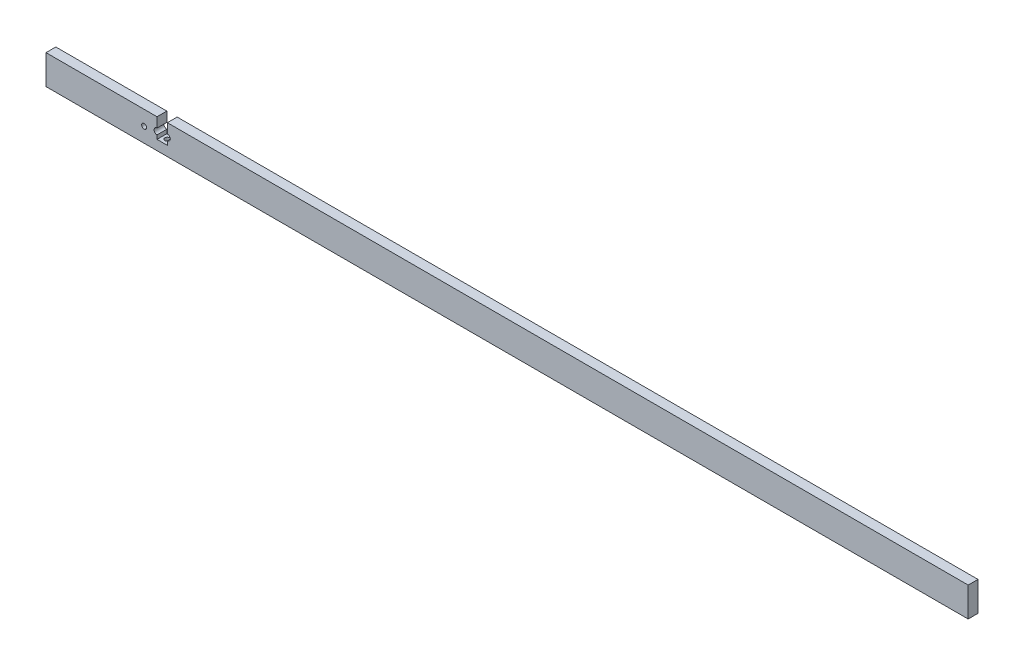
ISO-10303-21;
HEADER;
FILE_DESCRIPTION(('STEP AP214'),'2;1');
FILE_NAME('part.step','',(''),(''),'','','');
FILE_SCHEMA(('AUTOMOTIVE_DESIGN { 1 0 10303 214 1 1 1 1 }'));
ENDSEC;
DATA;
#1=APPLICATION_CONTEXT('core data for automotive mechanical design processes');
#2=APPLICATION_PROTOCOL_DEFINITION('international standard','automotive_design',2000,#1);
#3=PRODUCT_CONTEXT('',#1,'mechanical');
#4=PRODUCT('Part','Part','',(#3));
#5=PRODUCT_RELATED_PRODUCT_CATEGORY('part','',(#4));
#6=PRODUCT_DEFINITION_FORMATION('','',#4);
#7=PRODUCT_DEFINITION_CONTEXT('part definition',#1,'design');
#8=PRODUCT_DEFINITION('design','',#6,#7);
#9=PRODUCT_DEFINITION_SHAPE('','',#8);
#10=(LENGTH_UNIT() NAMED_UNIT(*) SI_UNIT(.MILLI.,.METRE.));
#11=(NAMED_UNIT(*) PLANE_ANGLE_UNIT() SI_UNIT($,.RADIAN.));
#12=(NAMED_UNIT(*) SI_UNIT($,.STERADIAN.) SOLID_ANGLE_UNIT());
#13=UNCERTAINTY_MEASURE_WITH_UNIT(LENGTH_MEASURE(1.E-05),#10,'distance_accuracy_value','');
#14=(GEOMETRIC_REPRESENTATION_CONTEXT(3) GLOBAL_UNCERTAINTY_ASSIGNED_CONTEXT((#13)) GLOBAL_UNIT_ASSIGNED_CONTEXT((#10,
#11,#12)) REPRESENTATION_CONTEXT('',''));
#15=CARTESIAN_POINT('',(0.,0.,0.));
#16=DIRECTION('',(0.,0.,1.));
#17=DIRECTION('',(1.,0.,0.));
#18=AXIS2_PLACEMENT_3D('',#15,#16,#17);
#19=CARTESIAN_POINT('',(-178.410038425183,7.50000000000003,0.));
#20=DIRECTION('',(-1.,0.,0.));
#21=DIRECTION('',(0.,-1.,0.));
#22=AXIS2_PLACEMENT_3D('',#19,#20,#21);
#23=PLANE('',#22);
#24=DIRECTION('',(0.,-1.,0.));
#25=VECTOR('',#24,1.);
#26=CARTESIAN_POINT('',(-178.410038425183,7.50000000000003,0.));
#27=LINE('',#26,#25);
#28=CARTESIAN_POINT('',(-178.410038425183,-0.499999999999966,0.));
#29=VERTEX_POINT('',#28);
#30=CARTESIAN_POINT('',(-178.410038425183,-2.49999999999997,0.));
#31=VERTEX_POINT('',#30);
#32=EDGE_CURVE('E145',#29,#31,#27,.T.);
#33=ORIENTED_EDGE('',*,*,#32,.F.);
#34=DIRECTION('',(0.,0.,1.));
#35=VECTOR('',#34,1.);
#36=CARTESIAN_POINT('',(-178.410038425183,-0.499999999999966,-5.));
#37=LINE('',#36,#35);
#38=CARTESIAN_POINT('',(-178.410038425183,-0.499999999999966,5.));
#39=VERTEX_POINT('',#38);
#40=EDGE_CURVE('E13',#29,#39,#37,.T.);
#41=ORIENTED_EDGE('',*,*,#40,.T.);
#42=DIRECTION('',(0.,-1.,0.));
#43=VECTOR('',#42,1.);
#44=CARTESIAN_POINT('',(-178.410038425183,7.50000000000003,5.));
#45=LINE('',#44,#43);
#46=CARTESIAN_POINT('',(-178.410038425183,-2.49999999999997,5.));
#47=VERTEX_POINT('',#46);
#48=EDGE_CURVE('E143',#39,#47,#45,.T.);
#49=ORIENTED_EDGE('',*,*,#48,.T.);
#50=DIRECTION('',(0.,0.,1.));
#51=VECTOR('',#50,1.);
#52=CARTESIAN_POINT('',(-178.410038425183,-2.49999999999997,0.));
#53=LINE('',#52,#51);
#54=EDGE_CURVE('E173',#31,#47,#53,.T.);
#55=ORIENTED_EDGE('',*,*,#54,.F.);
#56=EDGE_LOOP('',(#33,#41,#49,#55));
#57=FACE_BOUND('',#56,.T.);
#58=ADVANCED_FACE('F46',(#57),#23,.F.);
#59=CARTESIAN_POINT('',(-173.160038425183,-2.49999999999997,0.));
#60=DIRECTION('',(1.,0.,0.));
#61=DIRECTION('',(0.,0.,-1.));
#62=AXIS2_PLACEMENT_3D('',#59,#60,#61);
#63=PLANE('',#62);
#64=DIRECTION('',(0.,1.,0.));
#65=VECTOR('',#64,1.);
#66=CARTESIAN_POINT('',(-173.160038425183,-2.49999999999997,0.));
#67=LINE('',#66,#65);
#68=CARTESIAN_POINT('',(-173.160038425183,2.50000000000003,0.));
#69=VERTEX_POINT('',#68);
#70=CARTESIAN_POINT('',(-173.160038425183,7.50000000000003,0.));
#71=VERTEX_POINT('',#70);
#72=EDGE_CURVE('E232',#69,#71,#67,.T.);
#73=ORIENTED_EDGE('',*,*,#72,.F.);
#74=DIRECTION('',(0.,0.,1.));
#75=VECTOR('',#74,1.);
#76=CARTESIAN_POINT('',(-173.160038425183,2.50000000000003,-5.));
#77=LINE('',#76,#75);
#78=CARTESIAN_POINT('',(-173.160038425183,2.50000000000003,5.));
#79=VERTEX_POINT('',#78);
#80=EDGE_CURVE('E218',#69,#79,#77,.T.);
#81=ORIENTED_EDGE('',*,*,#80,.T.);
#82=DIRECTION('',(0.,1.,0.));
#83=VECTOR('',#82,1.);
#84=CARTESIAN_POINT('',(-173.160038425183,-2.49999999999997,5.));
#85=LINE('',#84,#83);
#86=CARTESIAN_POINT('',(-173.160038425183,7.50000000000003,5.));
#87=VERTEX_POINT('',#86);
#88=EDGE_CURVE('E163',#79,#87,#85,.T.);
#89=ORIENTED_EDGE('',*,*,#88,.T.);
#90=DIRECTION('',(0.,0.,1.));
#91=VECTOR('',#90,1.);
#92=CARTESIAN_POINT('',(-173.160038425183,7.50000000000003,0.));
#93=LINE('',#92,#91);
#94=EDGE_CURVE('E167',#71,#87,#93,.T.);
#95=ORIENTED_EDGE('',*,*,#94,.F.);
#96=EDGE_LOOP('',(#73,#81,#89,#95));
#97=FACE_BOUND('',#96,.T.);
#98=ADVANCED_FACE('F244',(#97),#63,.F.);
#99=CARTESIAN_POINT('',(235.,7.50000000000003,5.));
#100=DIRECTION('',(0.,-1.,0.));
#101=DIRECTION('',(1.,0.,0.));
#102=AXIS2_PLACEMENT_3D('',#99,#100,#101);
#103=PLANE('',#102);
#104=DIRECTION('',(-1.,0.,0.));
#105=VECTOR('',#104,1.);
#106=CARTESIAN_POINT('',(235.,7.50000000000003,0.));
#107=LINE('',#106,#105);
#108=CARTESIAN_POINT('',(235.,7.50000000000003,0.));
#109=VERTEX_POINT('',#108);
#110=EDGE_CURVE('E187',#109,#71,#107,.T.);
#111=ORIENTED_EDGE('',*,*,#110,.T.);
#112=ORIENTED_EDGE('',*,*,#94,.T.);
#113=DIRECTION('',(-1.,0.,0.));
#114=VECTOR('',#113,1.);
#115=CARTESIAN_POINT('',(235.,7.50000000000003,5.));
#116=LINE('',#115,#114);
#117=CARTESIAN_POINT('',(235.,7.50000000000003,5.));
#118=VERTEX_POINT('',#117);
#119=EDGE_CURVE('E192',#118,#87,#116,.T.);
#120=ORIENTED_EDGE('',*,*,#119,.F.);
#121=DIRECTION('',(0.,0.,-1.));
#122=VECTOR('',#121,1.);
#123=CARTESIAN_POINT('',(235.,7.50000000000003,5.));
#124=LINE('',#123,#122);
#125=EDGE_CURVE('E207',#118,#109,#124,.T.);
#126=ORIENTED_EDGE('',*,*,#125,.T.);
#127=EDGE_LOOP('',(#111,#112,#120,#126));
#128=FACE_BOUND('',#127,.T.);
#129=ADVANCED_FACE('F250',(#128),#103,.F.);
#130=CARTESIAN_POINT('',(-235.,-7.50000000000003,5.));
#131=DIRECTION('',(1.,0.,0.));
#132=DIRECTION('',(0.,0.,-1.));
#133=AXIS2_PLACEMENT_3D('',#130,#131,#132);
#134=PLANE('',#133);
#135=DIRECTION('',(0.,-1.,0.));
#136=VECTOR('',#135,1.);
#137=CARTESIAN_POINT('',(-235.,-7.50000000000003,0.));
#138=LINE('',#137,#136);
#139=CARTESIAN_POINT('',(-235.,7.49999999999998,0.));
#140=VERTEX_POINT('',#139);
#141=CARTESIAN_POINT('',(-235.,-7.50000000000003,0.));
#142=VERTEX_POINT('',#141);
#143=EDGE_CURVE('E180',#140,#142,#138,.T.);
#144=ORIENTED_EDGE('',*,*,#143,.T.);
#145=DIRECTION('',(0.,0.,-1.));
#146=VECTOR('',#145,1.);
#147=CARTESIAN_POINT('',(-235.,-7.50000000000003,5.));
#148=LINE('',#147,#146);
#149=CARTESIAN_POINT('',(-235.,-7.50000000000003,5.));
#150=VERTEX_POINT('',#149);
#151=EDGE_CURVE('E213',#150,#142,#148,.T.);
#152=ORIENTED_EDGE('',*,*,#151,.F.);
#153=DIRECTION('',(0.,-1.,0.));
#154=VECTOR('',#153,1.);
#155=CARTESIAN_POINT('',(-235.,-7.50000000000003,5.));
#156=LINE('',#155,#154);
#157=CARTESIAN_POINT('',(-235.,7.49999999999998,5.));
#158=VERTEX_POINT('',#157);
#159=EDGE_CURVE('E183',#158,#150,#156,.T.);
#160=ORIENTED_EDGE('',*,*,#159,.F.);
#161=DIRECTION('',(0.,0.,-1.));
#162=VECTOR('',#161,1.);
#163=CARTESIAN_POINT('',(-235.,7.49999999999998,5.));
#164=LINE('',#163,#162);
#165=EDGE_CURVE('E195',#158,#140,#164,.T.);
#166=ORIENTED_EDGE('',*,*,#165,.T.);
#167=EDGE_LOOP('',(#144,#152,#160,#166));
#168=FACE_BOUND('',#167,.T.);
#169=ADVANCED_FACE('F48',(#168),#134,.F.);
#170=CARTESIAN_POINT('',(235.,-7.49999999999998,5.));
#171=DIRECTION('',(0.,1.,0.));
#172=DIRECTION('',(-1.,0.,0.));
#173=AXIS2_PLACEMENT_3D('',#170,#171,#172);
#174=PLANE('',#173);
#175=CARTESIAN_POINT('',(-175.910038425183,-7.50000000000003,2.31270088468705));
#176=DIRECTION('',(0.,-1.,0.));
#177=DIRECTION('',(1.,0.,0.));
#178=AXIS2_PLACEMENT_3D('',#175,#176,#177);
#179=CIRCLE('',#178,1.25000000000001);
#180=CARTESIAN_POINT('',(-174.660038425183,-7.50000000000003,2.31270088468705));
#181=VERTEX_POINT('',#180);
#182=EDGE_CURVE('E156',#181,#181,#179,.T.);
#183=ORIENTED_EDGE('',*,*,#182,.F.);
#184=EDGE_LOOP('',(#183));
#185=FACE_BOUND('',#184,.T.);
#186=DIRECTION('',(1.,0.,0.));
#187=VECTOR('',#186,1.);
#188=CARTESIAN_POINT('',(235.,-7.49999999999998,0.));
#189=LINE('',#188,#187);
#190=CARTESIAN_POINT('',(235.,-7.49999999999998,0.));
#191=VERTEX_POINT('',#190);
#192=EDGE_CURVE('E198',#142,#191,#189,.T.);
#193=ORIENTED_EDGE('',*,*,#192,.T.);
#194=DIRECTION('',(0.,0.,-1.));
#195=VECTOR('',#194,1.);
#196=CARTESIAN_POINT('',(235.,-7.49999999999998,5.));
#197=LINE('',#196,#195);
#198=CARTESIAN_POINT('',(235.,-7.49999999999998,5.));
#199=VERTEX_POINT('',#198);
#200=EDGE_CURVE('E210',#199,#191,#197,.T.);
#201=ORIENTED_EDGE('',*,*,#200,.F.);
#202=DIRECTION('',(1.,0.,0.));
#203=VECTOR('',#202,1.);
#204=CARTESIAN_POINT('',(235.,-7.49999999999998,5.));
#205=LINE('',#204,#203);
#206=EDGE_CURVE('E186',#150,#199,#205,.T.);
#207=ORIENTED_EDGE('',*,*,#206,.F.);
#208=ORIENTED_EDGE('',*,*,#151,.T.);
#209=EDGE_LOOP('',(#193,#201,#207,#208));
#210=FACE_BOUND('',#209,.T.);
#211=ADVANCED_FACE('F290',(#185,#210),#174,.F.);
#212=CARTESIAN_POINT('',(235.,-7.49999999999998,5.));
#213=DIRECTION('',(-1.,0.,0.));
#214=DIRECTION('',(0.,0.,1.));
#215=AXIS2_PLACEMENT_3D('',#212,#213,#214);
#216=PLANE('',#215);
#217=DIRECTION('',(0.,1.,0.));
#218=VECTOR('',#217,1.);
#219=CARTESIAN_POINT('',(235.,-7.49999999999998,0.));
#220=LINE('',#219,#218);
#221=EDGE_CURVE('E200',#191,#109,#220,.T.);
#222=ORIENTED_EDGE('',*,*,#221,.T.);
#223=ORIENTED_EDGE('',*,*,#125,.F.);
#224=DIRECTION('',(0.,1.,0.));
#225=VECTOR('',#224,1.);
#226=CARTESIAN_POINT('',(235.,-7.49999999999998,5.));
#227=LINE('',#226,#225);
#228=EDGE_CURVE('E189',#199,#118,#227,.T.);
#229=ORIENTED_EDGE('',*,*,#228,.F.);
#230=ORIENTED_EDGE('',*,*,#200,.T.);
#231=EDGE_LOOP('',(#222,#223,#229,#230));
#232=FACE_BOUND('',#231,.T.);
#233=ADVANCED_FACE('F287',(#232),#216,.F.);
#234=CARTESIAN_POINT('',(-178.410038425183,7.50000000000003,5.));
#235=VERTEX_POINT('',#234);
#236=EDGE_CURVE('E191',#235,#158,#116,.T.);
#237=ORIENTED_EDGE('',*,*,#236,.F.);
#238=DIRECTION('',(0.,0.,1.));
#239=VECTOR('',#238,1.);
#240=CARTESIAN_POINT('',(-178.410038425183,7.50000000000003,0.));
#241=LINE('',#240,#239);
#242=CARTESIAN_POINT('',(-178.410038425183,7.50000000000003,0.));
#243=VERTEX_POINT('',#242);
#244=EDGE_CURVE('E175',#243,#235,#241,.T.);
#245=ORIENTED_EDGE('',*,*,#244,.F.);
#246=EDGE_CURVE('E202',#243,#140,#107,.T.);
#247=ORIENTED_EDGE('',*,*,#246,.T.);
#248=ORIENTED_EDGE('',*,*,#165,.F.);
#249=EDGE_LOOP('',(#237,#245,#247,#248));
#250=FACE_BOUND('',#249,.T.);
#251=ADVANCED_FACE('F281',(#250),#103,.F.);
#252=CARTESIAN_POINT('',(0.,0.,5.));
#253=DIRECTION('',(0.,0.,1.));
#254=DIRECTION('',(1.,0.,0.));
#255=AXIS2_PLACEMENT_3D('',#252,#253,#254);
#256=PLANE('',#255);
#257=CARTESIAN_POINT('',(-178.410038425183,1.00000000000003,5.));
#258=DIRECTION('',(0.,0.,1.));
#259=DIRECTION('',(1.,0.,0.));
#260=AXIS2_PLACEMENT_3D('',#257,#258,#259);
#261=CIRCLE('',#260,1.5);
#262=CARTESIAN_POINT('',(-178.410038425183,2.50000000000003,5.));
#263=VERTEX_POINT('',#262);
#264=EDGE_CURVE('E133',#263,#39,#261,.T.);
#265=ORIENTED_EDGE('',*,*,#264,.F.);
#266=EDGE_CURVE('E152',#235,#263,#45,.T.);
#267=ORIENTED_EDGE('',*,*,#266,.F.);
#268=ORIENTED_EDGE('',*,*,#236,.T.);
#269=ORIENTED_EDGE('',*,*,#159,.T.);
#270=ORIENTED_EDGE('',*,*,#206,.T.);
#271=ORIENTED_EDGE('',*,*,#228,.T.);
#272=ORIENTED_EDGE('',*,*,#119,.T.);
#273=ORIENTED_EDGE('',*,*,#88,.F.);
#274=CARTESIAN_POINT('',(-173.160038425183,1.00000000000003,5.));
#275=DIRECTION('',(0.,0.,1.));
#276=DIRECTION('',(-1.,0.,0.));
#277=AXIS2_PLACEMENT_3D('',#274,#275,#276);
#278=CIRCLE('',#277,1.5);
#279=CARTESIAN_POINT('',(-173.160038425183,-0.499999999999966,5.));
#280=VERTEX_POINT('',#279);
#281=EDGE_CURVE('E237',#280,#79,#278,.T.);
#282=ORIENTED_EDGE('',*,*,#281,.F.);
#283=CARTESIAN_POINT('',(-173.160038425183,-2.49999999999997,5.));
#284=VERTEX_POINT('',#283);
#285=EDGE_CURVE('E164',#284,#280,#85,.T.);
#286=ORIENTED_EDGE('',*,*,#285,.F.);
#287=DIRECTION('',(1.,0.,0.));
#288=VECTOR('',#287,1.);
#289=CARTESIAN_POINT('',(-178.410038425183,-2.49999999999997,5.));
#290=LINE('',#289,#288);
#291=EDGE_CURVE('E151',#47,#284,#290,.T.);
#292=ORIENTED_EDGE('',*,*,#291,.F.);
#293=ORIENTED_EDGE('',*,*,#48,.F.);
#294=EDGE_LOOP('',(#265,#267,#268,#269,#270,#271,#272,#273,#282,#286,#292,#293));
#295=FACE_BOUND('',#294,.T.);
#296=CARTESIAN_POINT('',(-185.,0.,5.));
#297=DIRECTION('',(0.,0.,1.));
#298=DIRECTION('',(1.,0.,0.));
#299=AXIS2_PLACEMENT_3D('',#296,#297,#298);
#300=CIRCLE('',#299,1.25000000000001);
#301=CARTESIAN_POINT('',(-183.75,0.,5.));
#302=VERTEX_POINT('',#301);
#303=EDGE_CURVE('E170',#302,#302,#300,.T.);
#304=ORIENTED_EDGE('',*,*,#303,.F.);
#305=EDGE_LOOP('',(#304));
#306=FACE_BOUND('',#305,.T.);
#307=ADVANCED_FACE('F147',(#295,#306),#256,.T.);
#308=CARTESIAN_POINT('',(0.,0.,0.));
#309=DIRECTION('',(0.,0.,1.));
#310=DIRECTION('',(1.,0.,0.));
#311=AXIS2_PLACEMENT_3D('',#308,#309,#310);
#312=PLANE('',#311);
#313=CARTESIAN_POINT('',(-185.,0.,0.));
#314=DIRECTION('',(0.,0.,1.));
#315=DIRECTION('',(1.,0.,0.));
#316=AXIS2_PLACEMENT_3D('',#313,#314,#315);
#317=CIRCLE('',#316,1.25000000000001);
#318=CARTESIAN_POINT('',(-183.75,0.,0.));
#319=VERTEX_POINT('',#318);
#320=EDGE_CURVE('E177',#319,#319,#317,.T.);
#321=ORIENTED_EDGE('',*,*,#320,.T.);
#322=EDGE_LOOP('',(#321));
#323=FACE_BOUND('',#322,.T.);
#324=CARTESIAN_POINT('',(-178.410038425183,2.50000000000003,0.));
#325=VERTEX_POINT('',#324);
#326=EDGE_CURVE('E223',#243,#325,#27,.T.);
#327=ORIENTED_EDGE('',*,*,#326,.T.);
#328=CARTESIAN_POINT('',(-178.410038425183,1.00000000000003,0.));
#329=DIRECTION('',(0.,0.,1.));
#330=DIRECTION('',(1.,0.,0.));
#331=AXIS2_PLACEMENT_3D('',#328,#329,#330);
#332=CIRCLE('',#331,1.5);
#333=EDGE_CURVE('E61',#325,#29,#332,.T.);
#334=ORIENTED_EDGE('',*,*,#333,.T.);
#335=ORIENTED_EDGE('',*,*,#32,.T.);
#336=DIRECTION('',(1.,0.,0.));
#337=VECTOR('',#336,1.);
#338=CARTESIAN_POINT('',(-178.410038425183,-2.49999999999997,0.));
#339=LINE('',#338,#337);
#340=CARTESIAN_POINT('',(-173.160038425183,-2.49999999999997,0.));
#341=VERTEX_POINT('',#340);
#342=EDGE_CURVE('E229',#31,#341,#339,.T.);
#343=ORIENTED_EDGE('',*,*,#342,.T.);
#344=CARTESIAN_POINT('',(-173.160038425183,-0.499999999999966,0.));
#345=VERTEX_POINT('',#344);
#346=EDGE_CURVE('E160',#341,#345,#67,.T.);
#347=ORIENTED_EDGE('',*,*,#346,.T.);
#348=CARTESIAN_POINT('',(-173.160038425183,1.00000000000003,0.));
#349=DIRECTION('',(0.,0.,1.));
#350=DIRECTION('',(1.,0.,0.));
#351=AXIS2_PLACEMENT_3D('',#348,#349,#350);
#352=CIRCLE('',#351,1.5);
#353=EDGE_CURVE('E69',#345,#69,#352,.T.);
#354=ORIENTED_EDGE('',*,*,#353,.T.);
#355=ORIENTED_EDGE('',*,*,#72,.T.);
#356=ORIENTED_EDGE('',*,*,#110,.F.);
#357=ORIENTED_EDGE('',*,*,#221,.F.);
#358=ORIENTED_EDGE('',*,*,#192,.F.);
#359=ORIENTED_EDGE('',*,*,#143,.F.);
#360=ORIENTED_EDGE('',*,*,#246,.F.);
#361=EDGE_LOOP('',(#327,#334,#335,#343,#347,#354,#355,#356,#357,#358,#359,#360));
#362=FACE_BOUND('',#361,.T.);
#363=ADVANCED_FACE('F227',(#323,#362),#312,.F.);
#364=CARTESIAN_POINT('',(-185.,0.,0.));
#365=DIRECTION('',(0.,0.,1.));
#366=DIRECTION('',(1.,0.,0.));
#367=AXIS2_PLACEMENT_3D('',#364,#365,#366);
#368=CYLINDRICAL_SURFACE('',#367,1.25000000000001);
#369=ORIENTED_EDGE('',*,*,#320,.F.);
#370=EDGE_LOOP('',(#369));
#371=FACE_BOUND('',#370,.T.);
#372=ORIENTED_EDGE('',*,*,#303,.T.);
#373=EDGE_LOOP('',(#372));
#374=FACE_BOUND('',#373,.T.);
#375=ADVANCED_FACE('F269',(#371,#374),#368,.F.);
#376=ORIENTED_EDGE('',*,*,#285,.T.);
#377=DIRECTION('',(0.,0.,1.));
#378=VECTOR('',#377,1.);
#379=CARTESIAN_POINT('',(-173.160038425183,-0.499999999999966,-5.));
#380=LINE('',#379,#378);
#381=EDGE_CURVE('E215',#280,#345,#380,.F.);
#382=ORIENTED_EDGE('',*,*,#381,.T.);
#383=ORIENTED_EDGE('',*,*,#346,.F.);
#384=DIRECTION('',(0.,0.,1.));
#385=VECTOR('',#384,1.);
#386=CARTESIAN_POINT('',(-173.160038425183,-2.49999999999997,0.));
#387=LINE('',#386,#385);
#388=EDGE_CURVE('E171',#341,#284,#387,.T.);
#389=ORIENTED_EDGE('',*,*,#388,.T.);
#390=EDGE_LOOP('',(#376,#382,#383,#389));
#391=FACE_BOUND('',#390,.T.);
#392=ADVANCED_FACE('F257',(#391),#63,.F.);
#393=CARTESIAN_POINT('',(-178.410038425183,-2.49999999999997,0.));
#394=DIRECTION('',(0.,-1.,0.));
#395=DIRECTION('',(0.,0.,-1.));
#396=AXIS2_PLACEMENT_3D('',#393,#394,#395);
#397=PLANE('',#396);
#398=CARTESIAN_POINT('',(-175.910038425183,-2.49999999999997,2.31270088468705));
#399=DIRECTION('',(0.,-1.,0.));
#400=DIRECTION('',(0.,0.,-1.));
#401=AXIS2_PLACEMENT_3D('',#398,#399,#400);
#402=CIRCLE('',#401,1.25000000000001);
#403=CARTESIAN_POINT('',(-175.910038425183,-2.49999999999997,1.06270088468704));
#404=VERTEX_POINT('',#403);
#405=EDGE_CURVE('E153',#404,#404,#402,.T.);
#406=ORIENTED_EDGE('',*,*,#405,.T.);
#407=EDGE_LOOP('',(#406));
#408=FACE_BOUND('',#407,.T.);
#409=ORIENTED_EDGE('',*,*,#291,.T.);
#410=ORIENTED_EDGE('',*,*,#388,.F.);
#411=ORIENTED_EDGE('',*,*,#342,.F.);
#412=ORIENTED_EDGE('',*,*,#54,.T.);
#413=EDGE_LOOP('',(#409,#410,#411,#412));
#414=FACE_BOUND('',#413,.T.);
#415=ADVANCED_FACE('F259',(#408,#414),#397,.F.);
#416=ORIENTED_EDGE('',*,*,#266,.T.);
#417=DIRECTION('',(0.,0.,1.));
#418=VECTOR('',#417,1.);
#419=CARTESIAN_POINT('',(-178.410038425183,2.50000000000003,-5.));
#420=LINE('',#419,#418);
#421=EDGE_CURVE('E54',#263,#325,#420,.F.);
#422=ORIENTED_EDGE('',*,*,#421,.T.);
#423=ORIENTED_EDGE('',*,*,#326,.F.);
#424=ORIENTED_EDGE('',*,*,#244,.T.);
#425=EDGE_LOOP('',(#416,#422,#423,#424));
#426=FACE_BOUND('',#425,.T.);
#427=ADVANCED_FACE('F222',(#426),#23,.F.);
#428=CARTESIAN_POINT('',(-175.910038425183,2.49999999999997,2.31270088468705));
#429=DIRECTION('',(0.,-1.,0.));
#430=DIRECTION('',(1.,0.,0.));
#431=AXIS2_PLACEMENT_3D('',#428,#429,#430);
#432=CYLINDRICAL_SURFACE('',#431,1.25000000000001);
#433=ORIENTED_EDGE('',*,*,#182,.T.);
#434=EDGE_LOOP('',(#433));
#435=FACE_BOUND('',#434,.T.);
#436=ORIENTED_EDGE('',*,*,#405,.F.);
#437=EDGE_LOOP('',(#436));
#438=FACE_BOUND('',#437,.T.);
#439=ADVANCED_FACE('F267',(#435,#438),#432,.F.);
#440=CARTESIAN_POINT('',(-173.160038425183,1.00000000000003,-5.));
#441=DIRECTION('',(0.,0.,1.));
#442=DIRECTION('',(1.,0.,0.));
#443=AXIS2_PLACEMENT_3D('',#440,#441,#442);
#444=CYLINDRICAL_SURFACE('',#443,1.5);
#445=ORIENTED_EDGE('',*,*,#381,.F.);
#446=ORIENTED_EDGE('',*,*,#281,.T.);
#447=ORIENTED_EDGE('',*,*,#80,.F.);
#448=ORIENTED_EDGE('',*,*,#353,.F.);
#449=EDGE_LOOP('',(#445,#446,#447,#448));
#450=FACE_BOUND('',#449,.T.);
#451=ADVANCED_FACE('F240',(#450),#444,.F.);
#452=CARTESIAN_POINT('',(-178.410038425183,1.00000000000003,-5.));
#453=DIRECTION('',(0.,0.,1.));
#454=DIRECTION('',(1.,0.,0.));
#455=AXIS2_PLACEMENT_3D('',#452,#453,#454);
#456=CYLINDRICAL_SURFACE('',#455,1.5);
#457=ORIENTED_EDGE('',*,*,#421,.F.);
#458=ORIENTED_EDGE('',*,*,#264,.T.);
#459=ORIENTED_EDGE('',*,*,#40,.F.);
#460=ORIENTED_EDGE('',*,*,#333,.F.);
#461=EDGE_LOOP('',(#457,#458,#459,#460));
#462=FACE_BOUND('',#461,.T.);
#463=ADVANCED_FACE('F134',(#462),#456,.F.);
#464=CLOSED_SHELL('',(#58,#98,#129,#169,#211,#233,#251,#307,#363,#375,#392,#415,#427,#439,#451,#463));
#465=MANIFOLD_SOLID_BREP('B2',#464);
#466=ADVANCED_BREP_SHAPE_REPRESENTATION('',(#18,#465),#14);
#467=SHAPE_DEFINITION_REPRESENTATION(#9,#466);
ENDSEC;
END-ISO-10303-21;
